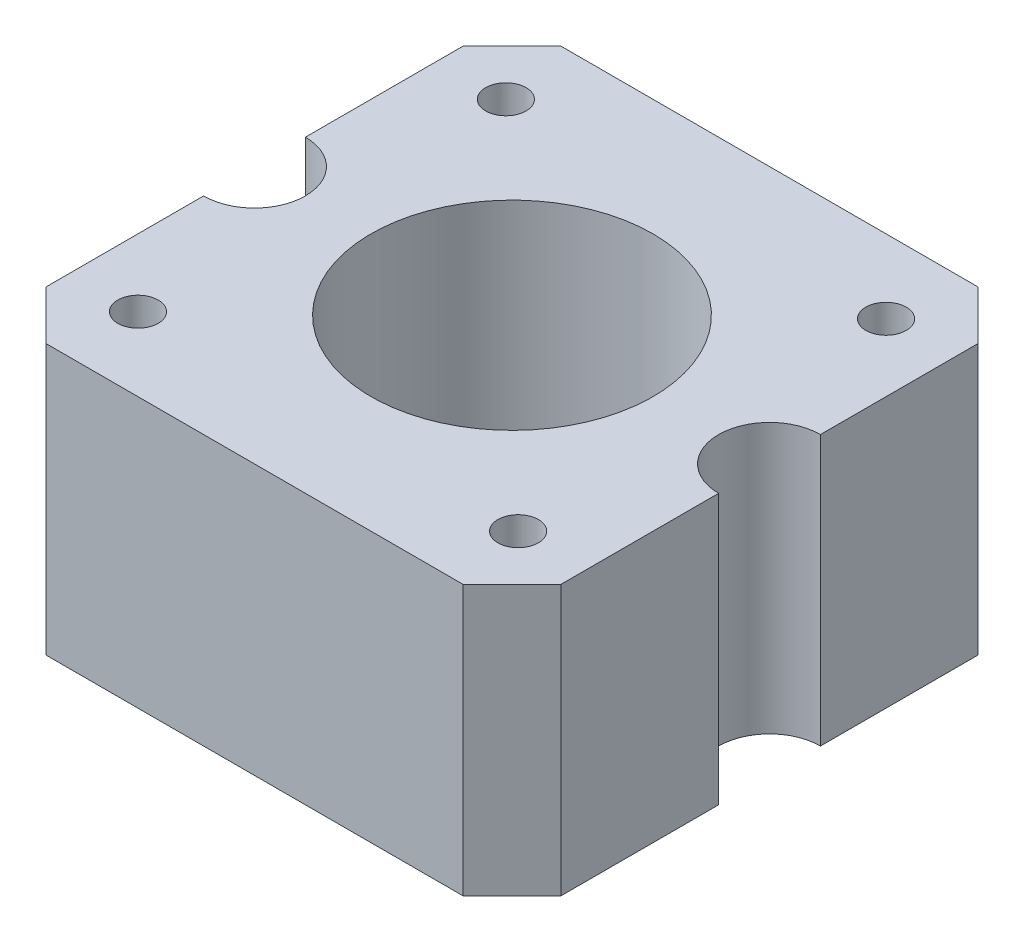
ISO-10303-21;
HEADER;
FILE_DESCRIPTION(('STEP AP214'),'2;1');
FILE_NAME('part.step','',(''),(''),'','','');
FILE_SCHEMA(('AUTOMOTIVE_DESIGN { 1 0 10303 214 1 1 1 1 }'));
ENDSEC;
DATA;
#1=APPLICATION_CONTEXT('core data for automotive mechanical design processes');
#2=APPLICATION_PROTOCOL_DEFINITION('international standard','automotive_design',2000,#1);
#3=PRODUCT_CONTEXT('',#1,'mechanical');
#4=PRODUCT('Part','Part','',(#3));
#5=PRODUCT_RELATED_PRODUCT_CATEGORY('part','',(#4));
#6=PRODUCT_DEFINITION_FORMATION('','',#4);
#7=PRODUCT_DEFINITION_CONTEXT('part definition',#1,'design');
#8=PRODUCT_DEFINITION('design','',#6,#7);
#9=PRODUCT_DEFINITION_SHAPE('','',#8);
#10=(LENGTH_UNIT() NAMED_UNIT(*) SI_UNIT(.MILLI.,.METRE.));
#11=(NAMED_UNIT(*) PLANE_ANGLE_UNIT() SI_UNIT($,.RADIAN.));
#12=(NAMED_UNIT(*) SI_UNIT($,.STERADIAN.) SOLID_ANGLE_UNIT());
#13=UNCERTAINTY_MEASURE_WITH_UNIT(LENGTH_MEASURE(1.E-05),#10,'distance_accuracy_value','');
#14=(GEOMETRIC_REPRESENTATION_CONTEXT(3) GLOBAL_UNCERTAINTY_ASSIGNED_CONTEXT((#13)) GLOBAL_UNIT_ASSIGNED_CONTEXT((#10,
#11,#12)) REPRESENTATION_CONTEXT('',''));
#15=CARTESIAN_POINT('',(0.,0.,0.));
#16=DIRECTION('',(0.,0.,1.));
#17=DIRECTION('',(1.,0.,0.));
#18=AXIS2_PLACEMENT_3D('',#15,#16,#17);
#19=CARTESIAN_POINT('',(21.,22.,21.));
#20=DIRECTION('',(-1.,0.,0.));
#21=DIRECTION('',(0.,0.,1.));
#22=AXIS2_PLACEMENT_3D('',#19,#20,#21);
#23=PLANE('',#22);
#24=DIRECTION('',(0.,1.,0.));
#25=VECTOR('',#24,1.);
#26=CARTESIAN_POINT('',(21.,-0.001000000000001,-4.14999999999999));
#27=LINE('',#26,#25);
#28=CARTESIAN_POINT('',(21.,0.,-4.14999999999999));
#29=VERTEX_POINT('',#28);
#30=CARTESIAN_POINT('',(21.,22.,-4.14999999999999));
#31=VERTEX_POINT('',#30);
#32=EDGE_CURVE('E539',#29,#31,#27,.T.);
#33=ORIENTED_EDGE('',*,*,#32,.F.);
#34=DIRECTION('',(0.,0.,-1.));
#35=VECTOR('',#34,1.);
#36=CARTESIAN_POINT('',(21.,0.,21.));
#37=LINE('',#36,#35);
#38=CARTESIAN_POINT('',(21.,0.,-17.));
#39=VERTEX_POINT('',#38);
#40=EDGE_CURVE('E163',#29,#39,#37,.T.);
#41=ORIENTED_EDGE('',*,*,#40,.T.);
#42=DIRECTION('',(0.,1.,0.));
#43=VECTOR('',#42,1.);
#44=CARTESIAN_POINT('',(21.,22.,-17.));
#45=LINE('',#44,#43);
#46=CARTESIAN_POINT('',(21.,22.,-17.));
#47=VERTEX_POINT('',#46);
#48=EDGE_CURVE('E189',#39,#47,#45,.T.);
#49=ORIENTED_EDGE('',*,*,#48,.T.);
#50=DIRECTION('',(0.,0.,-1.));
#51=VECTOR('',#50,1.);
#52=CARTESIAN_POINT('',(21.,22.,21.));
#53=LINE('',#52,#51);
#54=EDGE_CURVE('E171',#31,#47,#53,.T.);
#55=ORIENTED_EDGE('',*,*,#54,.F.);
#56=EDGE_LOOP('',(#33,#41,#49,#55));
#57=FACE_BOUND('',#56,.T.);
#58=ADVANCED_FACE('F35',(#57),#23,.F.);
#59=DIRECTION('',(0.,1.,0.));
#60=VECTOR('',#59,1.);
#61=CARTESIAN_POINT('',(21.,-0.001000000000001,4.15000000000001));
#62=LINE('',#61,#60);
#63=CARTESIAN_POINT('',(21.,22.,4.15000000000002));
#64=VERTEX_POINT('',#63);
#65=CARTESIAN_POINT('',(21.,0.,4.15000000000003));
#66=VERTEX_POINT('',#65);
#67=EDGE_CURVE('E61',#64,#66,#62,.F.);
#68=ORIENTED_EDGE('',*,*,#67,.F.);
#69=CARTESIAN_POINT('',(21.,22.,17.));
#70=VERTEX_POINT('',#69);
#71=EDGE_CURVE('E253',#70,#64,#53,.T.);
#72=ORIENTED_EDGE('',*,*,#71,.F.);
#73=DIRECTION('',(0.,-1.,0.));
#74=VECTOR('',#73,1.);
#75=CARTESIAN_POINT('',(21.,22.,17.));
#76=LINE('',#75,#74);
#77=CARTESIAN_POINT('',(21.,0.,17.));
#78=VERTEX_POINT('',#77);
#79=EDGE_CURVE('E186',#70,#78,#76,.T.);
#80=ORIENTED_EDGE('',*,*,#79,.T.);
#81=EDGE_CURVE('E159',#78,#66,#37,.T.);
#82=ORIENTED_EDGE('',*,*,#81,.T.);
#83=EDGE_LOOP('',(#68,#72,#80,#82));
#84=FACE_BOUND('',#83,.T.);
#85=ADVANCED_FACE('F288',(#84),#23,.F.);
#86=CARTESIAN_POINT('',(-21.,22.,21.));
#87=DIRECTION('',(1.,0.,0.));
#88=DIRECTION('',(0.,0.,-1.));
#89=AXIS2_PLACEMENT_3D('',#86,#87,#88);
#90=PLANE('',#89);
#91=DIRECTION('',(0.,1.,0.));
#92=VECTOR('',#91,1.);
#93=CARTESIAN_POINT('',(-21.,-0.001000000000001,4.15000000000001));
#94=LINE('',#93,#92);
#95=CARTESIAN_POINT('',(-21.,0.,4.15000000000001));
#96=VERTEX_POINT('',#95);
#97=CARTESIAN_POINT('',(-21.,22.,4.15000000000001));
#98=VERTEX_POINT('',#97);
#99=EDGE_CURVE('E127',#96,#98,#94,.T.);
#100=ORIENTED_EDGE('',*,*,#99,.F.);
#101=DIRECTION('',(0.,0.,1.));
#102=VECTOR('',#101,1.);
#103=CARTESIAN_POINT('',(-21.,0.,21.));
#104=LINE('',#103,#102);
#105=CARTESIAN_POINT('',(-21.,0.,17.));
#106=VERTEX_POINT('',#105);
#107=EDGE_CURVE('E166',#96,#106,#104,.T.);
#108=ORIENTED_EDGE('',*,*,#107,.T.);
#109=DIRECTION('',(0.,1.,0.));
#110=VECTOR('',#109,1.);
#111=CARTESIAN_POINT('',(-21.,22.,17.));
#112=LINE('',#111,#110);
#113=CARTESIAN_POINT('',(-21.,22.,17.));
#114=VERTEX_POINT('',#113);
#115=EDGE_CURVE('E199',#106,#114,#112,.T.);
#116=ORIENTED_EDGE('',*,*,#115,.T.);
#117=DIRECTION('',(0.,0.,1.));
#118=VECTOR('',#117,1.);
#119=CARTESIAN_POINT('',(-21.,22.,21.));
#120=LINE('',#119,#118);
#121=EDGE_CURVE('E150',#98,#114,#120,.T.);
#122=ORIENTED_EDGE('',*,*,#121,.F.);
#123=EDGE_LOOP('',(#100,#108,#116,#122));
#124=FACE_BOUND('',#123,.T.);
#125=ADVANCED_FACE('F294',(#124),#90,.F.);
#126=DIRECTION('',(0.,1.,0.));
#127=VECTOR('',#126,1.);
#128=CARTESIAN_POINT('',(-21.,-0.001000000000001,-4.14999999999999));
#129=LINE('',#128,#127);
#130=CARTESIAN_POINT('',(-21.,22.,-4.14999999999998));
#131=VERTEX_POINT('',#130);
#132=CARTESIAN_POINT('',(-21.,0.,-4.14999999999998));
#133=VERTEX_POINT('',#132);
#134=EDGE_CURVE('E53',#131,#133,#129,.F.);
#135=ORIENTED_EDGE('',*,*,#134,.F.);
#136=CARTESIAN_POINT('',(-21.,22.,-17.));
#137=VERTEX_POINT('',#136);
#138=EDGE_CURVE('E139',#137,#131,#120,.T.);
#139=ORIENTED_EDGE('',*,*,#138,.F.);
#140=DIRECTION('',(0.,-1.,0.));
#141=VECTOR('',#140,1.);
#142=CARTESIAN_POINT('',(-21.,22.,-17.));
#143=LINE('',#142,#141);
#144=CARTESIAN_POINT('',(-21.,0.,-17.));
#145=VERTEX_POINT('',#144);
#146=EDGE_CURVE('E202',#137,#145,#143,.T.);
#147=ORIENTED_EDGE('',*,*,#146,.T.);
#148=EDGE_CURVE('E142',#145,#133,#104,.T.);
#149=ORIENTED_EDGE('',*,*,#148,.T.);
#150=EDGE_LOOP('',(#135,#139,#147,#149));
#151=FACE_BOUND('',#150,.T.);
#152=ADVANCED_FACE('F137',(#151),#90,.F.);
#153=CARTESIAN_POINT('',(0.,22.,0.));
#154=DIRECTION('',(0.,-1.,0.));
#155=DIRECTION('',(0.,0.,-1.));
#156=AXIS2_PLACEMENT_3D('',#153,#154,#155);
#157=PLANE('',#156);
#158=CARTESIAN_POINT('',(-15.5,22.,15.));
#159=DIRECTION('',(0.,-1.,0.));
#160=DIRECTION('',(0.,0.,-1.));
#161=AXIS2_PLACEMENT_3D('',#158,#159,#160);
#162=CIRCLE('',#161,1.65);
#163=CARTESIAN_POINT('',(-15.5,22.,13.35));
#164=VERTEX_POINT('',#163);
#165=EDGE_CURVE('E251',#164,#164,#162,.F.);
#166=ORIENTED_EDGE('',*,*,#165,.F.);
#167=EDGE_LOOP('',(#166));
#168=FACE_BOUND('',#167,.T.);
#169=CARTESIAN_POINT('',(15.5,22.,15.));
#170=DIRECTION('',(0.,-1.,0.));
#171=DIRECTION('',(0.,0.,-1.));
#172=AXIS2_PLACEMENT_3D('',#169,#170,#171);
#173=CIRCLE('',#172,1.65);
#174=CARTESIAN_POINT('',(15.5,22.,13.35));
#175=VERTEX_POINT('',#174);
#176=EDGE_CURVE('E248',#175,#175,#173,.F.);
#177=ORIENTED_EDGE('',*,*,#176,.F.);
#178=EDGE_LOOP('',(#177));
#179=FACE_BOUND('',#178,.T.);
#180=CARTESIAN_POINT('',(15.5,22.,-15.));
#181=DIRECTION('',(0.,-1.,0.));
#182=DIRECTION('',(0.,0.,-1.));
#183=AXIS2_PLACEMENT_3D('',#180,#181,#182);
#184=CIRCLE('',#183,1.65);
#185=CARTESIAN_POINT('',(15.5,22.,-16.65));
#186=VERTEX_POINT('',#185);
#187=EDGE_CURVE('E245',#186,#186,#184,.F.);
#188=ORIENTED_EDGE('',*,*,#187,.F.);
#189=EDGE_LOOP('',(#188));
#190=FACE_BOUND('',#189,.T.);
#191=CARTESIAN_POINT('',(-15.5,22.,-15.));
#192=DIRECTION('',(0.,-1.,0.));
#193=DIRECTION('',(0.,0.,-1.));
#194=AXIS2_PLACEMENT_3D('',#191,#192,#193);
#195=CIRCLE('',#194,1.65);
#196=CARTESIAN_POINT('',(-15.5,22.,-16.65));
#197=VERTEX_POINT('',#196);
#198=EDGE_CURVE('E238',#197,#197,#195,.F.);
#199=ORIENTED_EDGE('',*,*,#198,.F.);
#200=EDGE_LOOP('',(#199));
#201=FACE_BOUND('',#200,.T.);
#202=CARTESIAN_POINT('',(0.,22.,0.));
#203=DIRECTION('',(0.,-1.,0.));
#204=DIRECTION('',(0.,0.,-1.));
#205=AXIS2_PLACEMENT_3D('',#202,#203,#204);
#206=CIRCLE('',#205,11.5);
#207=CARTESIAN_POINT('',(0.,22.,-11.5));
#208=VERTEX_POINT('',#207);
#209=EDGE_CURVE('E233',#208,#208,#206,.F.);
#210=ORIENTED_EDGE('',*,*,#209,.F.);
#211=EDGE_LOOP('',(#210));
#212=FACE_BOUND('',#211,.T.);
#213=CARTESIAN_POINT('',(-21.,22.,0.));
#214=DIRECTION('',(0.,-1.,0.));
#215=DIRECTION('',(0.,0.,-1.));
#216=AXIS2_PLACEMENT_3D('',#213,#214,#215);
#217=CIRCLE('',#216,4.15);
#218=EDGE_CURVE('E124',#98,#131,#217,.F.);
#219=ORIENTED_EDGE('',*,*,#218,.F.);
#220=ORIENTED_EDGE('',*,*,#121,.T.);
#221=DIRECTION('',(-0.707106781186546,0.,-0.707106781186549));
#222=VECTOR('',#221,1.);
#223=CARTESIAN_POINT('',(-17.,22.,21.));
#224=LINE('',#223,#222);
#225=CARTESIAN_POINT('',(-17.,22.,21.));
#226=VERTEX_POINT('',#225);
#227=EDGE_CURVE('E192',#114,#226,#224,.F.);
#228=ORIENTED_EDGE('',*,*,#227,.T.);
#229=DIRECTION('',(1.,0.,0.));
#230=VECTOR('',#229,1.);
#231=CARTESIAN_POINT('',(-21.,22.,21.));
#232=LINE('',#231,#230);
#233=CARTESIAN_POINT('',(17.,22.,21.));
#234=VERTEX_POINT('',#233);
#235=EDGE_CURVE('E149',#226,#234,#232,.T.);
#236=ORIENTED_EDGE('',*,*,#235,.T.);
#237=DIRECTION('',(-0.707106781186549,0.,0.707106781186546));
#238=VECTOR('',#237,1.);
#239=CARTESIAN_POINT('',(21.,22.,17.));
#240=LINE('',#239,#238);
#241=EDGE_CURVE('E194',#234,#70,#240,.F.);
#242=ORIENTED_EDGE('',*,*,#241,.T.);
#243=ORIENTED_EDGE('',*,*,#71,.T.);
#244=CARTESIAN_POINT('',(21.,22.,0.));
#245=DIRECTION('',(0.,-1.,0.));
#246=DIRECTION('',(0.,0.,-1.));
#247=AXIS2_PLACEMENT_3D('',#244,#245,#246);
#248=CIRCLE('',#247,4.15);
#249=EDGE_CURVE('E132',#31,#64,#248,.F.);
#250=ORIENTED_EDGE('',*,*,#249,.F.);
#251=ORIENTED_EDGE('',*,*,#54,.T.);
#252=DIRECTION('',(0.707106781186546,0.,0.707106781186549));
#253=VECTOR('',#252,1.);
#254=CARTESIAN_POINT('',(17.,22.,-21.));
#255=LINE('',#254,#253);
#256=CARTESIAN_POINT('',(17.,22.,-21.));
#257=VERTEX_POINT('',#256);
#258=EDGE_CURVE('E197',#47,#257,#255,.F.);
#259=ORIENTED_EDGE('',*,*,#258,.T.);
#260=DIRECTION('',(-1.,0.,0.));
#261=VECTOR('',#260,1.);
#262=CARTESIAN_POINT('',(-21.,22.,-21.));
#263=LINE('',#262,#261);
#264=CARTESIAN_POINT('',(-17.,22.,-21.));
#265=VERTEX_POINT('',#264);
#266=EDGE_CURVE('E155',#257,#265,#263,.T.);
#267=ORIENTED_EDGE('',*,*,#266,.T.);
#268=DIRECTION('',(0.707106781186549,0.,-0.707106781186546));
#269=VECTOR('',#268,1.);
#270=CARTESIAN_POINT('',(-21.,22.,-17.));
#271=LINE('',#270,#269);
#272=EDGE_CURVE('E148',#265,#137,#271,.F.);
#273=ORIENTED_EDGE('',*,*,#272,.T.);
#274=ORIENTED_EDGE('',*,*,#138,.T.);
#275=EDGE_LOOP('',(#219,#220,#228,#236,#242,#243,#250,#251,#259,#267,#273,#274));
#276=FACE_BOUND('',#275,.T.);
#277=ADVANCED_FACE('F145',(#168,#179,#190,#201,#212,#276),#157,.F.);
#278=CARTESIAN_POINT('',(0.,0.,0.));
#279=DIRECTION('',(0.,-1.,0.));
#280=DIRECTION('',(0.,0.,-1.));
#281=AXIS2_PLACEMENT_3D('',#278,#279,#280);
#282=PLANE('',#281);
#283=CARTESIAN_POINT('',(-15.5,0.,-15.));
#284=DIRECTION('',(0.,-1.,0.));
#285=DIRECTION('',(0.,0.,-1.));
#286=AXIS2_PLACEMENT_3D('',#283,#284,#285);
#287=CIRCLE('',#286,2.99999999999999);
#288=CARTESIAN_POINT('',(-15.5,0.,-18.));
#289=VERTEX_POINT('',#288);
#290=EDGE_CURVE('E40',#289,#289,#287,.F.);
#291=ORIENTED_EDGE('',*,*,#290,.T.);
#292=EDGE_LOOP('',(#291));
#293=FACE_BOUND('',#292,.T.);
#294=CARTESIAN_POINT('',(15.5,0.,-15.));
#295=DIRECTION('',(0.,-1.,0.));
#296=DIRECTION('',(0.,0.,-1.));
#297=AXIS2_PLACEMENT_3D('',#294,#295,#296);
#298=CIRCLE('',#297,3.);
#299=CARTESIAN_POINT('',(15.5,0.,-18.));
#300=VERTEX_POINT('',#299);
#301=EDGE_CURVE('E224',#300,#300,#298,.F.);
#302=ORIENTED_EDGE('',*,*,#301,.T.);
#303=EDGE_LOOP('',(#302));
#304=FACE_BOUND('',#303,.T.);
#305=CARTESIAN_POINT('',(15.5,0.,15.));
#306=DIRECTION('',(0.,-1.,0.));
#307=DIRECTION('',(0.,0.,-1.));
#308=AXIS2_PLACEMENT_3D('',#305,#306,#307);
#309=CIRCLE('',#308,3.);
#310=CARTESIAN_POINT('',(15.5,0.,12.));
#311=VERTEX_POINT('',#310);
#312=EDGE_CURVE('E222',#311,#311,#309,.F.);
#313=ORIENTED_EDGE('',*,*,#312,.T.);
#314=EDGE_LOOP('',(#313));
#315=FACE_BOUND('',#314,.T.);
#316=CARTESIAN_POINT('',(-15.5,0.,15.));
#317=DIRECTION('',(0.,-1.,0.));
#318=DIRECTION('',(0.,0.,-1.));
#319=AXIS2_PLACEMENT_3D('',#316,#317,#318);
#320=CIRCLE('',#319,3.);
#321=CARTESIAN_POINT('',(-15.5,0.,12.));
#322=VERTEX_POINT('',#321);
#323=EDGE_CURVE('E219',#322,#322,#320,.F.);
#324=ORIENTED_EDGE('',*,*,#323,.T.);
#325=EDGE_LOOP('',(#324));
#326=FACE_BOUND('',#325,.T.);
#327=CARTESIAN_POINT('',(0.,0.,0.));
#328=DIRECTION('',(0.,-1.,0.));
#329=DIRECTION('',(0.,0.,-1.));
#330=AXIS2_PLACEMENT_3D('',#327,#328,#329);
#331=CIRCLE('',#330,11.5);
#332=CARTESIAN_POINT('',(0.,0.,-11.5));
#333=VERTEX_POINT('',#332);
#334=EDGE_CURVE('E229',#333,#333,#331,.F.);
#335=ORIENTED_EDGE('',*,*,#334,.T.);
#336=EDGE_LOOP('',(#335));
#337=FACE_BOUND('',#336,.T.);
#338=ORIENTED_EDGE('',*,*,#107,.F.);
#339=CARTESIAN_POINT('',(-21.,0.,0.));
#340=DIRECTION('',(0.,-1.,0.));
#341=DIRECTION('',(0.,0.,-1.));
#342=AXIS2_PLACEMENT_3D('',#339,#340,#341);
#343=CIRCLE('',#342,4.15);
#344=EDGE_CURVE('E143',#96,#133,#343,.F.);
#345=ORIENTED_EDGE('',*,*,#344,.T.);
#346=ORIENTED_EDGE('',*,*,#148,.F.);
#347=DIRECTION('',(-0.707106781186549,0.,0.707106781186546));
#348=VECTOR('',#347,1.);
#349=CARTESIAN_POINT('',(-19.,0.,-19.));
#350=LINE('',#349,#348);
#351=CARTESIAN_POINT('',(-17.,0.,-21.));
#352=VERTEX_POINT('',#351);
#353=EDGE_CURVE('E181',#145,#352,#350,.F.);
#354=ORIENTED_EDGE('',*,*,#353,.T.);
#355=DIRECTION('',(-1.,0.,0.));
#356=VECTOR('',#355,1.);
#357=CARTESIAN_POINT('',(-21.,0.,-21.));
#358=LINE('',#357,#356);
#359=CARTESIAN_POINT('',(17.,0.,-21.));
#360=VERTEX_POINT('',#359);
#361=EDGE_CURVE('E162',#360,#352,#358,.T.);
#362=ORIENTED_EDGE('',*,*,#361,.F.);
#363=DIRECTION('',(-0.707106781186546,0.,-0.707106781186549));
#364=VECTOR('',#363,1.);
#365=CARTESIAN_POINT('',(19.,0.,-19.));
#366=LINE('',#365,#364);
#367=EDGE_CURVE('E183',#360,#39,#366,.F.);
#368=ORIENTED_EDGE('',*,*,#367,.T.);
#369=ORIENTED_EDGE('',*,*,#40,.F.);
#370=CARTESIAN_POINT('',(21.,0.,0.));
#371=DIRECTION('',(0.,-1.,0.));
#372=DIRECTION('',(0.,0.,-1.));
#373=AXIS2_PLACEMENT_3D('',#370,#371,#372);
#374=CIRCLE('',#373,4.15);
#375=EDGE_CURVE('E538',#29,#66,#374,.F.);
#376=ORIENTED_EDGE('',*,*,#375,.T.);
#377=ORIENTED_EDGE('',*,*,#81,.F.);
#378=DIRECTION('',(0.707106781186549,0.,-0.707106781186546));
#379=VECTOR('',#378,1.);
#380=CARTESIAN_POINT('',(19.,0.,19.));
#381=LINE('',#380,#379);
#382=CARTESIAN_POINT('',(17.,0.,21.));
#383=VERTEX_POINT('',#382);
#384=EDGE_CURVE('E179',#78,#383,#381,.F.);
#385=ORIENTED_EDGE('',*,*,#384,.T.);
#386=DIRECTION('',(1.,0.,0.));
#387=VECTOR('',#386,1.);
#388=CARTESIAN_POINT('',(-21.,0.,21.));
#389=LINE('',#388,#387);
#390=CARTESIAN_POINT('',(-17.,0.,21.));
#391=VERTEX_POINT('',#390);
#392=EDGE_CURVE('E168',#391,#383,#389,.T.);
#393=ORIENTED_EDGE('',*,*,#392,.F.);
#394=DIRECTION('',(0.707106781186546,0.,0.707106781186549));
#395=VECTOR('',#394,1.);
#396=CARTESIAN_POINT('',(-19.,0.,19.));
#397=LINE('',#396,#395);
#398=EDGE_CURVE('E176',#391,#106,#397,.F.);
#399=ORIENTED_EDGE('',*,*,#398,.T.);
#400=EDGE_LOOP('',(#338,#345,#346,#354,#362,#368,#369,#376,#377,#385,#393,#399));
#401=FACE_BOUND('',#400,.T.);
#402=ADVANCED_FACE('F273',(#293,#304,#315,#326,#337,#401),#282,.T.);
#403=CARTESIAN_POINT('',(15.5,22.000012,-15.));
#404=DIRECTION('',(0.,-1.,0.));
#405=DIRECTION('',(0.,0.,-1.));
#406=AXIS2_PLACEMENT_3D('',#403,#404,#405);
#407=CYLINDRICAL_SURFACE('',#406,1.65);
#408=ORIENTED_EDGE('',*,*,#187,.T.);
#409=EDGE_LOOP('',(#408));
#410=FACE_BOUND('',#409,.T.);
#411=CARTESIAN_POINT('',(15.5,5.,-15.));
#412=DIRECTION('',(0.,-1.,0.));
#413=DIRECTION('',(0.,0.,-1.));
#414=AXIS2_PLACEMENT_3D('',#411,#412,#413);
#415=CIRCLE('',#414,1.65);
#416=CARTESIAN_POINT('',(15.5,5.,-16.65));
#417=VERTEX_POINT('',#416);
#418=EDGE_CURVE('E213',#417,#417,#415,.T.);
#419=ORIENTED_EDGE('',*,*,#418,.T.);
#420=EDGE_LOOP('',(#419));
#421=FACE_BOUND('',#420,.T.);
#422=ADVANCED_FACE('F320',(#410,#421),#407,.F.);
#423=CARTESIAN_POINT('',(-15.5,22.000012,15.));
#424=DIRECTION('',(0.,-1.,0.));
#425=DIRECTION('',(0.,0.,-1.));
#426=AXIS2_PLACEMENT_3D('',#423,#424,#425);
#427=CYLINDRICAL_SURFACE('',#426,1.65);
#428=ORIENTED_EDGE('',*,*,#165,.T.);
#429=EDGE_LOOP('',(#428));
#430=FACE_BOUND('',#429,.T.);
#431=CARTESIAN_POINT('',(-15.5,5.,15.));
#432=DIRECTION('',(0.,-1.,0.));
#433=DIRECTION('',(0.,0.,-1.));
#434=AXIS2_PLACEMENT_3D('',#431,#432,#433);
#435=CIRCLE('',#434,1.65);
#436=CARTESIAN_POINT('',(-15.5,5.,13.35));
#437=VERTEX_POINT('',#436);
#438=EDGE_CURVE('E206',#437,#437,#435,.T.);
#439=ORIENTED_EDGE('',*,*,#438,.T.);
#440=EDGE_LOOP('',(#439));
#441=FACE_BOUND('',#440,.T.);
#442=ADVANCED_FACE('F310',(#430,#441),#427,.F.);
#443=CARTESIAN_POINT('',(-21.,22.,-21.));
#444=DIRECTION('',(0.,0.,1.));
#445=DIRECTION('',(1.,0.,0.));
#446=AXIS2_PLACEMENT_3D('',#443,#444,#445);
#447=PLANE('',#446);
#448=ORIENTED_EDGE('',*,*,#266,.F.);
#449=DIRECTION('',(0.,-1.,0.));
#450=VECTOR('',#449,1.);
#451=CARTESIAN_POINT('',(17.,22.,-21.));
#452=LINE('',#451,#450);
#453=EDGE_CURVE('E173',#257,#360,#452,.T.);
#454=ORIENTED_EDGE('',*,*,#453,.T.);
#455=ORIENTED_EDGE('',*,*,#361,.T.);
#456=DIRECTION('',(0.,1.,0.));
#457=VECTOR('',#456,1.);
#458=CARTESIAN_POINT('',(-17.,22.,-21.));
#459=LINE('',#458,#457);
#460=EDGE_CURVE('E153',#352,#265,#459,.T.);
#461=ORIENTED_EDGE('',*,*,#460,.T.);
#462=EDGE_LOOP('',(#448,#454,#455,#461));
#463=FACE_BOUND('',#462,.T.);
#464=ADVANCED_FACE('F269',(#463),#447,.F.);
#465=CARTESIAN_POINT('',(-21.,22.,21.));
#466=DIRECTION('',(0.,0.,-1.));
#467=DIRECTION('',(-1.,0.,0.));
#468=AXIS2_PLACEMENT_3D('',#465,#466,#467);
#469=PLANE('',#468);
#470=ORIENTED_EDGE('',*,*,#392,.T.);
#471=DIRECTION('',(0.,1.,0.));
#472=VECTOR('',#471,1.);
#473=CARTESIAN_POINT('',(17.,22.,21.));
#474=LINE('',#473,#472);
#475=EDGE_CURVE('E11',#383,#234,#474,.T.);
#476=ORIENTED_EDGE('',*,*,#475,.T.);
#477=ORIENTED_EDGE('',*,*,#235,.F.);
#478=DIRECTION('',(0.,-1.,0.));
#479=VECTOR('',#478,1.);
#480=CARTESIAN_POINT('',(-17.,22.,21.));
#481=LINE('',#480,#479);
#482=EDGE_CURVE('E45',#226,#391,#481,.T.);
#483=ORIENTED_EDGE('',*,*,#482,.T.);
#484=EDGE_LOOP('',(#470,#476,#477,#483));
#485=FACE_BOUND('',#484,.T.);
#486=ADVANCED_FACE('F309',(#485),#469,.F.);
#487=CARTESIAN_POINT('',(0.,22.000012,0.));
#488=DIRECTION('',(0.,-1.,0.));
#489=DIRECTION('',(0.,0.,-1.));
#490=AXIS2_PLACEMENT_3D('',#487,#488,#489);
#491=CYLINDRICAL_SURFACE('',#490,11.5);
#492=ORIENTED_EDGE('',*,*,#334,.F.);
#493=EDGE_LOOP('',(#492));
#494=FACE_BOUND('',#493,.T.);
#495=ORIENTED_EDGE('',*,*,#209,.T.);
#496=EDGE_LOOP('',(#495));
#497=FACE_BOUND('',#496,.T.);
#498=ADVANCED_FACE('F316',(#494,#497),#491,.F.);
#499=CARTESIAN_POINT('',(-15.5,22.000012,-15.));
#500=DIRECTION('',(0.,-1.,0.));
#501=DIRECTION('',(0.,0.,-1.));
#502=AXIS2_PLACEMENT_3D('',#499,#500,#501);
#503=CYLINDRICAL_SURFACE('',#502,1.65);
#504=CARTESIAN_POINT('',(-15.5,5.,-15.));
#505=DIRECTION('',(0.,1.,0.));
#506=DIRECTION('',(0.,0.,1.));
#507=AXIS2_PLACEMENT_3D('',#504,#505,#506);
#508=CIRCLE('',#507,1.65);
#509=CARTESIAN_POINT('',(-15.5,5.,-13.35));
#510=VERTEX_POINT('',#509);
#511=EDGE_CURVE('E216',#510,#510,#508,.T.);
#512=ORIENTED_EDGE('',*,*,#511,.F.);
#513=EDGE_LOOP('',(#512));
#514=FACE_BOUND('',#513,.T.);
#515=ORIENTED_EDGE('',*,*,#198,.T.);
#516=EDGE_LOOP('',(#515));
#517=FACE_BOUND('',#516,.T.);
#518=ADVANCED_FACE('F326',(#514,#517),#503,.F.);
#519=CARTESIAN_POINT('',(15.5,22.000012,15.));
#520=DIRECTION('',(0.,-1.,0.));
#521=DIRECTION('',(0.,0.,-1.));
#522=AXIS2_PLACEMENT_3D('',#519,#520,#521);
#523=CYLINDRICAL_SURFACE('',#522,1.65);
#524=CARTESIAN_POINT('',(15.5,5.,15.));
#525=DIRECTION('',(0.,1.,0.));
#526=DIRECTION('',(0.,0.,1.));
#527=AXIS2_PLACEMENT_3D('',#524,#525,#526);
#528=CIRCLE('',#527,1.65);
#529=CARTESIAN_POINT('',(15.5,5.,16.65));
#530=VERTEX_POINT('',#529);
#531=EDGE_CURVE('E209',#530,#530,#528,.T.);
#532=ORIENTED_EDGE('',*,*,#531,.F.);
#533=EDGE_LOOP('',(#532));
#534=FACE_BOUND('',#533,.T.);
#535=ORIENTED_EDGE('',*,*,#176,.T.);
#536=EDGE_LOOP('',(#535));
#537=FACE_BOUND('',#536,.T.);
#538=ADVANCED_FACE('F284',(#534,#537),#523,.F.);
#539=CARTESIAN_POINT('',(17.,22.,-21.));
#540=DIRECTION('',(-0.707106781186549,0.,0.707106781186546));
#541=DIRECTION('',(0.,-1.,0.));
#542=AXIS2_PLACEMENT_3D('',#539,#540,#541);
#543=PLANE('',#542);
#544=ORIENTED_EDGE('',*,*,#258,.F.);
#545=ORIENTED_EDGE('',*,*,#48,.F.);
#546=ORIENTED_EDGE('',*,*,#367,.F.);
#547=ORIENTED_EDGE('',*,*,#453,.F.);
#548=EDGE_LOOP('',(#544,#545,#546,#547));
#549=FACE_BOUND('',#548,.T.);
#550=ADVANCED_FACE('F266',(#549),#543,.F.);
#551=CARTESIAN_POINT('',(-21.,22.,-17.));
#552=DIRECTION('',(0.707106781186546,0.,0.707106781186549));
#553=DIRECTION('',(0.,-1.,0.));
#554=AXIS2_PLACEMENT_3D('',#551,#552,#553);
#555=PLANE('',#554);
#556=ORIENTED_EDGE('',*,*,#272,.F.);
#557=ORIENTED_EDGE('',*,*,#460,.F.);
#558=ORIENTED_EDGE('',*,*,#353,.F.);
#559=ORIENTED_EDGE('',*,*,#146,.F.);
#560=EDGE_LOOP('',(#556,#557,#558,#559));
#561=FACE_BOUND('',#560,.T.);
#562=ADVANCED_FACE('F275',(#561),#555,.F.);
#563=CARTESIAN_POINT('',(21.,22.,17.));
#564=DIRECTION('',(-0.707106781186546,0.,-0.707106781186549));
#565=DIRECTION('',(0.,-1.,0.));
#566=AXIS2_PLACEMENT_3D('',#563,#564,#565);
#567=PLANE('',#566);
#568=ORIENTED_EDGE('',*,*,#241,.F.);
#569=ORIENTED_EDGE('',*,*,#475,.F.);
#570=ORIENTED_EDGE('',*,*,#384,.F.);
#571=ORIENTED_EDGE('',*,*,#79,.F.);
#572=EDGE_LOOP('',(#568,#569,#570,#571));
#573=FACE_BOUND('',#572,.T.);
#574=ADVANCED_FACE('F277',(#573),#567,.F.);
#575=CARTESIAN_POINT('',(-17.,22.,21.));
#576=DIRECTION('',(0.707106781186549,0.,-0.707106781186546));
#577=DIRECTION('',(0.,-1.,0.));
#578=AXIS2_PLACEMENT_3D('',#575,#576,#577);
#579=PLANE('',#578);
#580=ORIENTED_EDGE('',*,*,#227,.F.);
#581=ORIENTED_EDGE('',*,*,#115,.F.);
#582=ORIENTED_EDGE('',*,*,#398,.F.);
#583=ORIENTED_EDGE('',*,*,#482,.F.);
#584=EDGE_LOOP('',(#580,#581,#582,#583));
#585=FACE_BOUND('',#584,.T.);
#586=ADVANCED_FACE('F38',(#585),#579,.F.);
#587=CARTESIAN_POINT('',(-15.5,-1.2E-05,15.));
#588=DIRECTION('',(0.,1.,0.));
#589=DIRECTION('',(0.,0.,1.));
#590=AXIS2_PLACEMENT_3D('',#587,#588,#589);
#591=CYLINDRICAL_SURFACE('',#590,3.);
#592=ORIENTED_EDGE('',*,*,#323,.F.);
#593=EDGE_LOOP('',(#592));
#594=FACE_BOUND('',#593,.T.);
#595=CARTESIAN_POINT('',(-15.5,5.,15.));
#596=DIRECTION('',(0.,-1.,0.));
#597=DIRECTION('',(0.,0.,-1.));
#598=AXIS2_PLACEMENT_3D('',#595,#596,#597);
#599=CIRCLE('',#598,3.);
#600=CARTESIAN_POINT('',(-15.5,5.,12.));
#601=VERTEX_POINT('',#600);
#602=EDGE_CURVE('E210',#601,#601,#599,.T.);
#603=ORIENTED_EDGE('',*,*,#602,.F.);
#604=EDGE_LOOP('',(#603));
#605=FACE_BOUND('',#604,.T.);
#606=ADVANCED_FACE('F340',(#594,#605),#591,.F.);
#607=CARTESIAN_POINT('',(-15.5,5.,15.));
#608=DIRECTION('',(0.,-1.,0.));
#609=DIRECTION('',(0.,0.,-1.));
#610=AXIS2_PLACEMENT_3D('',#607,#608,#609);
#611=PLANE('',#610);
#612=ORIENTED_EDGE('',*,*,#438,.F.);
#613=EDGE_LOOP('',(#612));
#614=FACE_BOUND('',#613,.T.);
#615=ORIENTED_EDGE('',*,*,#602,.T.);
#616=EDGE_LOOP('',(#615));
#617=FACE_BOUND('',#616,.T.);
#618=ADVANCED_FACE('F343',(#614,#617),#611,.T.);
#619=CARTESIAN_POINT('',(15.5,-1.2E-05,15.));
#620=DIRECTION('',(0.,1.,0.));
#621=DIRECTION('',(0.,0.,1.));
#622=AXIS2_PLACEMENT_3D('',#619,#620,#621);
#623=CYLINDRICAL_SURFACE('',#622,3.);
#624=ORIENTED_EDGE('',*,*,#312,.F.);
#625=EDGE_LOOP('',(#624));
#626=FACE_BOUND('',#625,.T.);
#627=CARTESIAN_POINT('',(15.5,5.,15.));
#628=DIRECTION('',(0.,-1.,0.));
#629=DIRECTION('',(0.,0.,1.));
#630=AXIS2_PLACEMENT_3D('',#627,#628,#629);
#631=CIRCLE('',#630,3.);
#632=CARTESIAN_POINT('',(15.5,5.,18.));
#633=VERTEX_POINT('',#632);
#634=EDGE_CURVE('E546',#633,#633,#631,.T.);
#635=ORIENTED_EDGE('',*,*,#634,.F.);
#636=EDGE_LOOP('',(#635));
#637=FACE_BOUND('',#636,.T.);
#638=ADVANCED_FACE('F347',(#626,#637),#623,.F.);
#639=CARTESIAN_POINT('',(15.5,5.,15.));
#640=DIRECTION('',(0.,1.,0.));
#641=DIRECTION('',(0.,0.,1.));
#642=AXIS2_PLACEMENT_3D('',#639,#640,#641);
#643=PLANE('',#642);
#644=ORIENTED_EDGE('',*,*,#531,.T.);
#645=EDGE_LOOP('',(#644));
#646=FACE_BOUND('',#645,.T.);
#647=ORIENTED_EDGE('',*,*,#634,.T.);
#648=EDGE_LOOP('',(#647));
#649=FACE_BOUND('',#648,.T.);
#650=ADVANCED_FACE('F362',(#646,#649),#643,.F.);
#651=CARTESIAN_POINT('',(15.5,-1.2E-05,-15.));
#652=DIRECTION('',(0.,1.,0.));
#653=DIRECTION('',(0.,0.,1.));
#654=AXIS2_PLACEMENT_3D('',#651,#652,#653);
#655=CYLINDRICAL_SURFACE('',#654,3.);
#656=ORIENTED_EDGE('',*,*,#301,.F.);
#657=EDGE_LOOP('',(#656));
#658=FACE_BOUND('',#657,.T.);
#659=CARTESIAN_POINT('',(15.5,5.,-15.));
#660=DIRECTION('',(0.,-1.,0.));
#661=DIRECTION('',(0.,0.,-1.));
#662=AXIS2_PLACEMENT_3D('',#659,#660,#661);
#663=CIRCLE('',#662,3.);
#664=CARTESIAN_POINT('',(15.5,5.,-18.));
#665=VERTEX_POINT('',#664);
#666=EDGE_CURVE('E549',#665,#665,#663,.T.);
#667=ORIENTED_EDGE('',*,*,#666,.F.);
#668=EDGE_LOOP('',(#667));
#669=FACE_BOUND('',#668,.T.);
#670=ADVANCED_FACE('F359',(#658,#669),#655,.F.);
#671=CARTESIAN_POINT('',(15.5,5.,-15.));
#672=DIRECTION('',(0.,-1.,0.));
#673=DIRECTION('',(0.,0.,-1.));
#674=AXIS2_PLACEMENT_3D('',#671,#672,#673);
#675=PLANE('',#674);
#676=ORIENTED_EDGE('',*,*,#418,.F.);
#677=EDGE_LOOP('',(#676));
#678=FACE_BOUND('',#677,.T.);
#679=ORIENTED_EDGE('',*,*,#666,.T.);
#680=EDGE_LOOP('',(#679));
#681=FACE_BOUND('',#680,.T.);
#682=ADVANCED_FACE('F353',(#678,#681),#675,.T.);
#683=CARTESIAN_POINT('',(-15.5,-1.2E-05,-15.));
#684=DIRECTION('',(0.,1.,0.));
#685=DIRECTION('',(0.,0.,1.));
#686=AXIS2_PLACEMENT_3D('',#683,#684,#685);
#687=CYLINDRICAL_SURFACE('',#686,2.99999999999999);
#688=ORIENTED_EDGE('',*,*,#290,.F.);
#689=EDGE_LOOP('',(#688));
#690=FACE_BOUND('',#689,.T.);
#691=CARTESIAN_POINT('',(-15.5,5.,-15.));
#692=DIRECTION('',(0.,-1.,0.));
#693=DIRECTION('',(0.,0.,1.));
#694=AXIS2_PLACEMENT_3D('',#691,#692,#693);
#695=CIRCLE('',#694,2.99999999999999);
#696=CARTESIAN_POINT('',(-15.5,5.,-12.));
#697=VERTEX_POINT('',#696);
#698=EDGE_CURVE('E131',#697,#697,#695,.T.);
#699=ORIENTED_EDGE('',*,*,#698,.F.);
#700=EDGE_LOOP('',(#699));
#701=FACE_BOUND('',#700,.T.);
#702=ADVANCED_FACE('F349',(#690,#701),#687,.F.);
#703=CARTESIAN_POINT('',(-15.5,5.,-15.));
#704=DIRECTION('',(0.,1.,0.));
#705=DIRECTION('',(0.,0.,1.));
#706=AXIS2_PLACEMENT_3D('',#703,#704,#705);
#707=PLANE('',#706);
#708=ORIENTED_EDGE('',*,*,#511,.T.);
#709=EDGE_LOOP('',(#708));
#710=FACE_BOUND('',#709,.T.);
#711=ORIENTED_EDGE('',*,*,#698,.T.);
#712=EDGE_LOOP('',(#711));
#713=FACE_BOUND('',#712,.T.);
#714=ADVANCED_FACE('F352',(#710,#713),#707,.F.);
#715=CARTESIAN_POINT('',(21.,22.000012,0.));
#716=DIRECTION('',(0.,-1.,0.));
#717=DIRECTION('',(0.,0.,-1.));
#718=AXIS2_PLACEMENT_3D('',#715,#716,#717);
#719=CYLINDRICAL_SURFACE('',#718,4.15);
#720=ORIENTED_EDGE('',*,*,#249,.T.);
#721=ORIENTED_EDGE('',*,*,#67,.T.);
#722=ORIENTED_EDGE('',*,*,#375,.F.);
#723=ORIENTED_EDGE('',*,*,#32,.T.);
#724=EDGE_LOOP('',(#720,#721,#722,#723));
#725=FACE_BOUND('',#724,.T.);
#726=ADVANCED_FACE('F357',(#725),#719,.F.);
#727=CARTESIAN_POINT('',(-21.,22.000012,0.));
#728=DIRECTION('',(0.,-1.,0.));
#729=DIRECTION('',(0.,0.,-1.));
#730=AXIS2_PLACEMENT_3D('',#727,#728,#729);
#731=CYLINDRICAL_SURFACE('',#730,4.15);
#732=ORIENTED_EDGE('',*,*,#218,.T.);
#733=ORIENTED_EDGE('',*,*,#134,.T.);
#734=ORIENTED_EDGE('',*,*,#344,.F.);
#735=ORIENTED_EDGE('',*,*,#99,.T.);
#736=EDGE_LOOP('',(#732,#733,#734,#735));
#737=FACE_BOUND('',#736,.T.);
#738=ADVANCED_FACE('F125',(#737),#731,.F.);
#739=CLOSED_SHELL('',(#58,#85,#125,#152,#277,#402,#422,#442,#464,#486,#498,#518,#538,#550,#562,
#574,#586,#606,#618,#638,#650,#670,#682,#702,#714,#726,#738));
#740=MANIFOLD_SOLID_BREP('B2',#739);
#741=ADVANCED_BREP_SHAPE_REPRESENTATION('',(#18,#740),#14);
#742=SHAPE_DEFINITION_REPRESENTATION(#9,#741);
ENDSEC;
END-ISO-10303-21;
